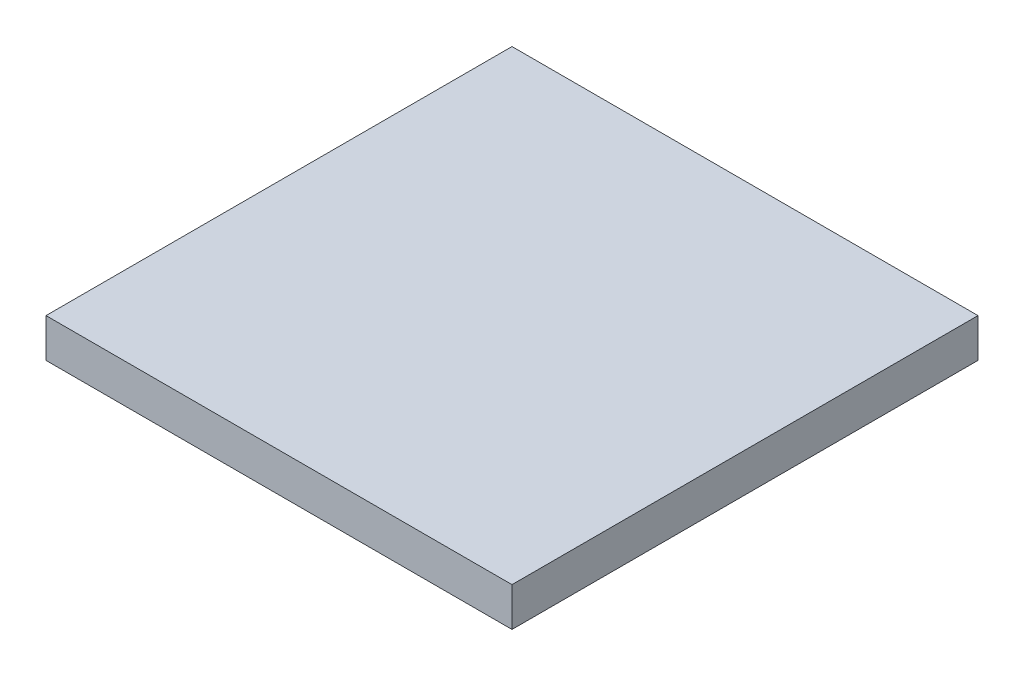
ISO-10303-21;
HEADER;
FILE_DESCRIPTION(('STEP AP214'),'2;1');
FILE_NAME('part.step','',(''),(''),'','','');
FILE_SCHEMA(('AUTOMOTIVE_DESIGN { 1 0 10303 214 1 1 1 1 }'));
ENDSEC;
DATA;
#1=APPLICATION_CONTEXT('core data for automotive mechanical design processes');
#2=APPLICATION_PROTOCOL_DEFINITION('international standard','automotive_design',2000,#1);
#3=PRODUCT_CONTEXT('',#1,'mechanical');
#4=PRODUCT('Part','Part','',(#3));
#5=PRODUCT_RELATED_PRODUCT_CATEGORY('part','',(#4));
#6=PRODUCT_DEFINITION_FORMATION('','',#4);
#7=PRODUCT_DEFINITION_CONTEXT('part definition',#1,'design');
#8=PRODUCT_DEFINITION('design','',#6,#7);
#9=PRODUCT_DEFINITION_SHAPE('','',#8);
#10=(LENGTH_UNIT() NAMED_UNIT(*) SI_UNIT(.MILLI.,.METRE.));
#11=(NAMED_UNIT(*) PLANE_ANGLE_UNIT() SI_UNIT($,.RADIAN.));
#12=(NAMED_UNIT(*) SI_UNIT($,.STERADIAN.) SOLID_ANGLE_UNIT());
#13=UNCERTAINTY_MEASURE_WITH_UNIT(LENGTH_MEASURE(1.E-05),#10,'distance_accuracy_value','');
#14=(GEOMETRIC_REPRESENTATION_CONTEXT(3) GLOBAL_UNCERTAINTY_ASSIGNED_CONTEXT((#13)) GLOBAL_UNIT_ASSIGNED_CONTEXT((#10,
#11,#12)) REPRESENTATION_CONTEXT('',''));
#15=CARTESIAN_POINT('',(0.,0.,0.));
#16=DIRECTION('',(0.,0.,1.));
#17=DIRECTION('',(1.,0.,0.));
#18=AXIS2_PLACEMENT_3D('',#15,#16,#17);
#19=CARTESIAN_POINT('',(5.97,10.7884215050598,-2.73));
#20=DIRECTION('',(-1.,0.,0.));
#21=DIRECTION('',(0.,0.,1.));
#22=AXIS2_PLACEMENT_3D('',#19,#20,#21);
#23=PLANE('',#22);
#24=DIRECTION('',(0.,0.,-1.));
#25=VECTOR('',#24,1.);
#26=CARTESIAN_POINT('',(5.97,5.78842150505978,-2.73));
#27=LINE('',#26,#25);
#28=CARTESIAN_POINT('',(5.97,5.78842150505978,2.73));
#29=VERTEX_POINT('',#28);
#30=CARTESIAN_POINT('',(5.97,5.78842150505978,-2.73));
#31=VERTEX_POINT('',#30);
#32=EDGE_CURVE('E134',#29,#31,#27,.T.);
#33=ORIENTED_EDGE('',*,*,#32,.T.);
#34=DIRECTION('',(0.,-1.,0.));
#35=VECTOR('',#34,1.);
#36=CARTESIAN_POINT('',(5.97,10.7884215050598,-2.73));
#37=LINE('',#36,#35);
#38=CARTESIAN_POINT('',(5.97,10.7884215050598,-2.73));
#39=VERTEX_POINT('',#38);
#40=EDGE_CURVE('E11',#39,#31,#37,.T.);
#41=ORIENTED_EDGE('',*,*,#40,.F.);
#42=DIRECTION('',(0.,0.,-1.));
#43=VECTOR('',#42,1.);
#44=CARTESIAN_POINT('',(5.97,10.7884215050598,-2.73));
#45=LINE('',#44,#43);
#46=CARTESIAN_POINT('',(5.97,10.7884215050598,2.73));
#47=VERTEX_POINT('',#46);
#48=EDGE_CURVE('E143',#47,#39,#45,.T.);
#49=ORIENTED_EDGE('',*,*,#48,.F.);
#50=DIRECTION('',(0.,-1.,0.));
#51=VECTOR('',#50,1.);
#52=CARTESIAN_POINT('',(5.97,10.7884215050598,2.73));
#53=LINE('',#52,#51);
#54=EDGE_CURVE('E152',#47,#29,#53,.T.);
#55=ORIENTED_EDGE('',*,*,#54,.T.);
#56=EDGE_LOOP('',(#33,#41,#49,#55));
#57=FACE_BOUND('',#56,.T.);
#58=ADVANCED_FACE('F36',(#57),#23,.F.);
#59=CARTESIAN_POINT('',(-5.97,10.7884215050598,-2.73));
#60=DIRECTION('',(0.,0.,1.));
#61=DIRECTION('',(1.,0.,0.));
#62=AXIS2_PLACEMENT_3D('',#59,#60,#61);
#63=PLANE('',#62);
#64=CARTESIAN_POINT('',(4.82,6.91342150505978,-2.73));
#65=DIRECTION('',(0.,0.,-1.));
#66=DIRECTION('',(1.,0.,0.));
#67=AXIS2_PLACEMENT_3D('',#64,#65,#66);
#68=CIRCLE('',#67,0.500000000000001);
#69=CARTESIAN_POINT('',(5.32,6.91342150505978,-2.73));
#70=VERTEX_POINT('',#69);
#71=EDGE_CURVE('E251',#70,#70,#68,.T.);
#72=ORIENTED_EDGE('',*,*,#71,.F.);
#73=EDGE_LOOP('',(#72));
#74=FACE_BOUND('',#73,.T.);
#75=CARTESIAN_POINT('',(4.82,9.16342150505978,-2.73));
#76=DIRECTION('',(0.,0.,-1.));
#77=DIRECTION('',(1.,0.,0.));
#78=AXIS2_PLACEMENT_3D('',#75,#76,#77);
#79=CIRCLE('',#78,0.500000000000001);
#80=CARTESIAN_POINT('',(5.32,9.16342150505978,-2.73));
#81=VERTEX_POINT('',#80);
#82=EDGE_CURVE('E257',#81,#81,#79,.T.);
#83=ORIENTED_EDGE('',*,*,#82,.F.);
#84=EDGE_LOOP('',(#83));
#85=FACE_BOUND('',#84,.T.);
#86=CARTESIAN_POINT('',(-4.82,9.16342150505978,-2.73));
#87=DIRECTION('',(0.,0.,-1.));
#88=DIRECTION('',(-1.,0.,0.));
#89=AXIS2_PLACEMENT_3D('',#86,#87,#88);
#90=CIRCLE('',#89,0.500000000000001);
#91=CARTESIAN_POINT('',(-5.32,9.16342150505978,-2.73));
#92=VERTEX_POINT('',#91);
#93=EDGE_CURVE('E263',#92,#92,#90,.T.);
#94=ORIENTED_EDGE('',*,*,#93,.F.);
#95=EDGE_LOOP('',(#94));
#96=FACE_BOUND('',#95,.T.);
#97=CARTESIAN_POINT('',(-4.82,6.91342150505978,-2.73));
#98=DIRECTION('',(0.,0.,-1.));
#99=DIRECTION('',(-1.,0.,0.));
#100=AXIS2_PLACEMENT_3D('',#97,#98,#99);
#101=CIRCLE('',#100,0.500000000000001);
#102=CARTESIAN_POINT('',(-5.32,6.91342150505978,-2.73));
#103=VERTEX_POINT('',#102);
#104=EDGE_CURVE('E245',#103,#103,#101,.T.);
#105=ORIENTED_EDGE('',*,*,#104,.F.);
#106=EDGE_LOOP('',(#105));
#107=FACE_BOUND('',#106,.T.);
#108=DIRECTION('',(-1.,0.,0.));
#109=VECTOR('',#108,1.);
#110=CARTESIAN_POINT('',(-5.97,5.78842150505978,-2.73));
#111=LINE('',#110,#109);
#112=CARTESIAN_POINT('',(-5.97,5.78842150505978,-2.73));
#113=VERTEX_POINT('',#112);
#114=EDGE_CURVE('E137',#31,#113,#111,.T.);
#115=ORIENTED_EDGE('',*,*,#114,.T.);
#116=DIRECTION('',(0.,-1.,0.));
#117=VECTOR('',#116,1.);
#118=CARTESIAN_POINT('',(-5.97,10.7884215050598,-2.73));
#119=LINE('',#118,#117);
#120=CARTESIAN_POINT('',(-5.97,10.7884215050598,-2.73));
#121=VERTEX_POINT('',#120);
#122=EDGE_CURVE('E44',#121,#113,#119,.T.);
#123=ORIENTED_EDGE('',*,*,#122,.F.);
#124=DIRECTION('',(-1.,0.,0.));
#125=VECTOR('',#124,1.);
#126=CARTESIAN_POINT('',(-5.97,10.7884215050598,-2.73));
#127=LINE('',#126,#125);
#128=EDGE_CURVE('E78',#39,#121,#127,.T.);
#129=ORIENTED_EDGE('',*,*,#128,.F.);
#130=ORIENTED_EDGE('',*,*,#40,.T.);
#131=EDGE_LOOP('',(#115,#123,#129,#130));
#132=FACE_BOUND('',#131,.T.);
#133=ADVANCED_FACE('F178',(#74,#85,#96,#107,#132),#63,.F.);
#134=CARTESIAN_POINT('',(-5.97,10.7884215050598,-2.73));
#135=DIRECTION('',(1.,0.,0.));
#136=DIRECTION('',(0.,0.,-1.));
#137=AXIS2_PLACEMENT_3D('',#134,#135,#136);
#138=PLANE('',#137);
#139=DIRECTION('',(0.,0.,1.));
#140=VECTOR('',#139,1.);
#141=CARTESIAN_POINT('',(-5.97,5.78842150505978,-2.73));
#142=LINE('',#141,#140);
#143=CARTESIAN_POINT('',(-5.97,5.78842150505978,2.73));
#144=VERTEX_POINT('',#143);
#145=EDGE_CURVE('E68',#113,#144,#142,.T.);
#146=ORIENTED_EDGE('',*,*,#145,.T.);
#147=DIRECTION('',(0.,-1.,0.));
#148=VECTOR('',#147,1.);
#149=CARTESIAN_POINT('',(-5.97,10.7884215050598,2.73));
#150=LINE('',#149,#148);
#151=CARTESIAN_POINT('',(-5.97,10.7884215050598,2.73));
#152=VERTEX_POINT('',#151);
#153=EDGE_CURVE('E52',#152,#144,#150,.T.);
#154=ORIENTED_EDGE('',*,*,#153,.F.);
#155=DIRECTION('',(0.,0.,1.));
#156=VECTOR('',#155,1.);
#157=CARTESIAN_POINT('',(-5.97,10.7884215050598,-2.73));
#158=LINE('',#157,#156);
#159=EDGE_CURVE('E147',#121,#152,#158,.T.);
#160=ORIENTED_EDGE('',*,*,#159,.F.);
#161=ORIENTED_EDGE('',*,*,#122,.T.);
#162=EDGE_LOOP('',(#146,#154,#160,#161));
#163=FACE_BOUND('',#162,.T.);
#164=ADVANCED_FACE('F158',(#163),#138,.F.);
#165=CARTESIAN_POINT('',(-5.97,10.7884215050598,2.73));
#166=DIRECTION('',(0.,0.,-1.));
#167=DIRECTION('',(-1.,0.,0.));
#168=AXIS2_PLACEMENT_3D('',#165,#166,#167);
#169=PLANE('',#168);
#170=CARTESIAN_POINT('',(-4.82,6.91342150505978,2.73));
#171=DIRECTION('',(0.,0.,1.));
#172=DIRECTION('',(-1.,0.,0.));
#173=AXIS2_PLACEMENT_3D('',#170,#171,#172);
#174=CIRCLE('',#173,0.5);
#175=CARTESIAN_POINT('',(-5.32,6.91342150505978,2.73));
#176=VERTEX_POINT('',#175);
#177=EDGE_CURVE('E227',#176,#176,#174,.T.);
#178=ORIENTED_EDGE('',*,*,#177,.F.);
#179=EDGE_LOOP('',(#178));
#180=FACE_BOUND('',#179,.T.);
#181=CARTESIAN_POINT('',(-4.82,9.16342150505978,2.73));
#182=DIRECTION('',(0.,0.,1.));
#183=DIRECTION('',(-1.,0.,0.));
#184=AXIS2_PLACEMENT_3D('',#181,#182,#183);
#185=CIRCLE('',#184,0.5);
#186=CARTESIAN_POINT('',(-5.32,9.16342150505978,2.73));
#187=VERTEX_POINT('',#186);
#188=EDGE_CURVE('E234',#187,#187,#185,.T.);
#189=ORIENTED_EDGE('',*,*,#188,.F.);
#190=EDGE_LOOP('',(#189));
#191=FACE_BOUND('',#190,.T.);
#192=CARTESIAN_POINT('',(4.82,9.16342150505978,2.73));
#193=DIRECTION('',(0.,0.,1.));
#194=DIRECTION('',(1.,0.,0.));
#195=AXIS2_PLACEMENT_3D('',#192,#193,#194);
#196=CIRCLE('',#195,0.5);
#197=CARTESIAN_POINT('',(5.32,9.16342150505978,2.73));
#198=VERTEX_POINT('',#197);
#199=EDGE_CURVE('E240',#198,#198,#196,.T.);
#200=ORIENTED_EDGE('',*,*,#199,.F.);
#201=EDGE_LOOP('',(#200));
#202=FACE_BOUND('',#201,.T.);
#203=CARTESIAN_POINT('',(4.82,6.91342150505978,2.73));
#204=DIRECTION('',(0.,0.,1.));
#205=DIRECTION('',(1.,0.,0.));
#206=AXIS2_PLACEMENT_3D('',#203,#204,#205);
#207=CIRCLE('',#206,0.5);
#208=CARTESIAN_POINT('',(5.32,6.91342150505978,2.73));
#209=VERTEX_POINT('',#208);
#210=EDGE_CURVE('E218',#209,#209,#207,.T.);
#211=ORIENTED_EDGE('',*,*,#210,.F.);
#212=EDGE_LOOP('',(#211));
#213=FACE_BOUND('',#212,.T.);
#214=DIRECTION('',(1.,0.,0.));
#215=VECTOR('',#214,1.);
#216=CARTESIAN_POINT('',(-5.97,5.78842150505978,2.73));
#217=LINE('',#216,#215);
#218=EDGE_CURVE('E73',#144,#29,#217,.T.);
#219=ORIENTED_EDGE('',*,*,#218,.T.);
#220=ORIENTED_EDGE('',*,*,#54,.F.);
#221=DIRECTION('',(1.,0.,0.));
#222=VECTOR('',#221,1.);
#223=CARTESIAN_POINT('',(-5.97,10.7884215050598,2.73));
#224=LINE('',#223,#222);
#225=EDGE_CURVE('E150',#152,#47,#224,.T.);
#226=ORIENTED_EDGE('',*,*,#225,.F.);
#227=ORIENTED_EDGE('',*,*,#153,.T.);
#228=EDGE_LOOP('',(#219,#220,#226,#227));
#229=FACE_BOUND('',#228,.T.);
#230=ADVANCED_FACE('F163',(#180,#191,#202,#213,#229),#169,.F.);
#231=CARTESIAN_POINT('',(0.,5.78842150505978,0.));
#232=DIRECTION('',(0.,1.,0.));
#233=DIRECTION('',(0.,0.,1.));
#234=AXIS2_PLACEMENT_3D('',#231,#232,#233);
#235=PLANE('',#234);
#236=ORIENTED_EDGE('',*,*,#32,.F.);
#237=ORIENTED_EDGE('',*,*,#218,.F.);
#238=ORIENTED_EDGE('',*,*,#145,.F.);
#239=ORIENTED_EDGE('',*,*,#114,.F.);
#240=EDGE_LOOP('',(#236,#237,#238,#239));
#241=FACE_BOUND('',#240,.T.);
#242=ADVANCED_FACE('F161',(#241),#235,.F.);
#243=CARTESIAN_POINT('',(0.,10.7884215050598,0.));
#244=DIRECTION('',(0.,1.,0.));
#245=DIRECTION('',(0.,0.,1.));
#246=AXIS2_PLACEMENT_3D('',#243,#244,#245);
#247=PLANE('',#246);
#248=DIRECTION('',(0.,0.,-1.));
#249=VECTOR('',#248,1.);
#250=CARTESIAN_POINT('',(15.,10.7884215050598,-15.));
#251=LINE('',#250,#249);
#252=CARTESIAN_POINT('',(15.,10.7884215050598,15.));
#253=VERTEX_POINT('',#252);
#254=CARTESIAN_POINT('',(15.,10.7884215050598,-15.));
#255=VERTEX_POINT('',#254);
#256=EDGE_CURVE('E133',#253,#255,#251,.T.);
#257=ORIENTED_EDGE('',*,*,#256,.F.);
#258=DIRECTION('',(1.,0.,0.));
#259=VECTOR('',#258,1.);
#260=CARTESIAN_POINT('',(-15.,10.7884215050598,15.));
#261=LINE('',#260,#259);
#262=CARTESIAN_POINT('',(-15.,10.7884215050598,15.));
#263=VERTEX_POINT('',#262);
#264=EDGE_CURVE('E129',#263,#253,#261,.T.);
#265=ORIENTED_EDGE('',*,*,#264,.F.);
#266=DIRECTION('',(0.,0.,1.));
#267=VECTOR('',#266,1.);
#268=CARTESIAN_POINT('',(-15.,10.7884215050598,-15.));
#269=LINE('',#268,#267);
#270=CARTESIAN_POINT('',(-15.,10.7884215050598,-15.));
#271=VERTEX_POINT('',#270);
#272=EDGE_CURVE('E210',#271,#263,#269,.T.);
#273=ORIENTED_EDGE('',*,*,#272,.F.);
#274=DIRECTION('',(-1.,0.,0.));
#275=VECTOR('',#274,1.);
#276=CARTESIAN_POINT('',(-15.,10.7884215050598,-15.));
#277=LINE('',#276,#275);
#278=EDGE_CURVE('E213',#255,#271,#277,.T.);
#279=ORIENTED_EDGE('',*,*,#278,.F.);
#280=EDGE_LOOP('',(#257,#265,#273,#279));
#281=FACE_BOUND('',#280,.T.);
#282=ORIENTED_EDGE('',*,*,#225,.T.);
#283=ORIENTED_EDGE('',*,*,#48,.T.);
#284=ORIENTED_EDGE('',*,*,#128,.T.);
#285=ORIENTED_EDGE('',*,*,#159,.T.);
#286=EDGE_LOOP('',(#282,#283,#284,#285));
#287=FACE_BOUND('',#286,.T.);
#288=ADVANCED_FACE('F165',(#281,#287),#247,.F.);
#289=CARTESIAN_POINT('',(15.,13.2884215050598,-15.));
#290=DIRECTION('',(-1.,0.,0.));
#291=DIRECTION('',(0.,0.,1.));
#292=AXIS2_PLACEMENT_3D('',#289,#290,#291);
#293=PLANE('',#292);
#294=ORIENTED_EDGE('',*,*,#256,.T.);
#295=DIRECTION('',(0.,-1.,0.));
#296=VECTOR('',#295,1.);
#297=CARTESIAN_POINT('',(15.,13.2884215050598,-15.));
#298=LINE('',#297,#296);
#299=CARTESIAN_POINT('',(15.,13.2884215050598,-15.));
#300=VERTEX_POINT('',#299);
#301=EDGE_CURVE('E113',#300,#255,#298,.T.);
#302=ORIENTED_EDGE('',*,*,#301,.F.);
#303=DIRECTION('',(0.,0.,-1.));
#304=VECTOR('',#303,1.);
#305=CARTESIAN_POINT('',(15.,13.2884215050598,-15.));
#306=LINE('',#305,#304);
#307=CARTESIAN_POINT('',(15.,13.2884215050598,15.));
#308=VERTEX_POINT('',#307);
#309=EDGE_CURVE('E120',#308,#300,#306,.T.);
#310=ORIENTED_EDGE('',*,*,#309,.F.);
#311=DIRECTION('',(0.,-1.,0.));
#312=VECTOR('',#311,1.);
#313=CARTESIAN_POINT('',(15.,13.2884215050598,15.));
#314=LINE('',#313,#312);
#315=EDGE_CURVE('E207',#308,#253,#314,.T.);
#316=ORIENTED_EDGE('',*,*,#315,.T.);
#317=EDGE_LOOP('',(#294,#302,#310,#316));
#318=FACE_BOUND('',#317,.T.);
#319=ADVANCED_FACE('F131',(#318),#293,.F.);
#320=CARTESIAN_POINT('',(-15.,13.2884215050598,-15.));
#321=DIRECTION('',(0.,0.,1.));
#322=DIRECTION('',(1.,0.,0.));
#323=AXIS2_PLACEMENT_3D('',#320,#321,#322);
#324=PLANE('',#323);
#325=ORIENTED_EDGE('',*,*,#278,.T.);
#326=DIRECTION('',(0.,-1.,0.));
#327=VECTOR('',#326,1.);
#328=CARTESIAN_POINT('',(-15.,13.2884215050598,-15.));
#329=LINE('',#328,#327);
#330=CARTESIAN_POINT('',(-15.,13.2884215050598,-15.));
#331=VERTEX_POINT('',#330);
#332=EDGE_CURVE('E116',#331,#271,#329,.T.);
#333=ORIENTED_EDGE('',*,*,#332,.F.);
#334=DIRECTION('',(-1.,0.,0.));
#335=VECTOR('',#334,1.);
#336=CARTESIAN_POINT('',(-15.,13.2884215050598,-15.));
#337=LINE('',#336,#335);
#338=EDGE_CURVE('E109',#300,#331,#337,.T.);
#339=ORIENTED_EDGE('',*,*,#338,.F.);
#340=ORIENTED_EDGE('',*,*,#301,.T.);
#341=EDGE_LOOP('',(#325,#333,#339,#340));
#342=FACE_BOUND('',#341,.T.);
#343=ADVANCED_FACE('F111',(#342),#324,.F.);
#344=CARTESIAN_POINT('',(-15.,13.2884215050598,-15.));
#345=DIRECTION('',(1.,0.,0.));
#346=DIRECTION('',(0.,0.,-1.));
#347=AXIS2_PLACEMENT_3D('',#344,#345,#346);
#348=PLANE('',#347);
#349=ORIENTED_EDGE('',*,*,#272,.T.);
#350=DIRECTION('',(0.,-1.,0.));
#351=VECTOR('',#350,1.);
#352=CARTESIAN_POINT('',(-15.,13.2884215050598,15.));
#353=LINE('',#352,#351);
#354=CARTESIAN_POINT('',(-15.,13.2884215050598,15.));
#355=VERTEX_POINT('',#354);
#356=EDGE_CURVE('E139',#355,#263,#353,.T.);
#357=ORIENTED_EDGE('',*,*,#356,.F.);
#358=DIRECTION('',(0.,0.,1.));
#359=VECTOR('',#358,1.);
#360=CARTESIAN_POINT('',(-15.,13.2884215050598,-15.));
#361=LINE('',#360,#359);
#362=EDGE_CURVE('E119',#331,#355,#361,.T.);
#363=ORIENTED_EDGE('',*,*,#362,.F.);
#364=ORIENTED_EDGE('',*,*,#332,.T.);
#365=EDGE_LOOP('',(#349,#357,#363,#364));
#366=FACE_BOUND('',#365,.T.);
#367=ADVANCED_FACE('F195',(#366),#348,.F.);
#368=CARTESIAN_POINT('',(-15.,13.2884215050598,15.));
#369=DIRECTION('',(0.,0.,-1.));
#370=DIRECTION('',(-1.,0.,0.));
#371=AXIS2_PLACEMENT_3D('',#368,#369,#370);
#372=PLANE('',#371);
#373=ORIENTED_EDGE('',*,*,#264,.T.);
#374=ORIENTED_EDGE('',*,*,#315,.F.);
#375=DIRECTION('',(1.,0.,0.));
#376=VECTOR('',#375,1.);
#377=CARTESIAN_POINT('',(-15.,13.2884215050598,15.));
#378=LINE('',#377,#376);
#379=EDGE_CURVE('E125',#355,#308,#378,.T.);
#380=ORIENTED_EDGE('',*,*,#379,.F.);
#381=ORIENTED_EDGE('',*,*,#356,.T.);
#382=EDGE_LOOP('',(#373,#374,#380,#381));
#383=FACE_BOUND('',#382,.T.);
#384=ADVANCED_FACE('F197',(#383),#372,.F.);
#385=CARTESIAN_POINT('',(0.,13.2884215050598,0.));
#386=DIRECTION('',(0.,1.,0.));
#387=DIRECTION('',(0.,0.,1.));
#388=AXIS2_PLACEMENT_3D('',#385,#386,#387);
#389=PLANE('',#388);
#390=ORIENTED_EDGE('',*,*,#309,.T.);
#391=ORIENTED_EDGE('',*,*,#338,.T.);
#392=ORIENTED_EDGE('',*,*,#362,.T.);
#393=ORIENTED_EDGE('',*,*,#379,.T.);
#394=EDGE_LOOP('',(#390,#391,#392,#393));
#395=FACE_BOUND('',#394,.T.);
#396=ADVANCED_FACE('F123',(#395),#389,.T.);
#397=CARTESIAN_POINT('',(4.82,6.91342150505978,1.23));
#398=DIRECTION('',(0.,0.,1.));
#399=DIRECTION('',(1.,0.,0.));
#400=AXIS2_PLACEMENT_3D('',#397,#398,#399);
#401=CYLINDRICAL_SURFACE('',#400,0.5);
#402=CARTESIAN_POINT('',(4.82,6.91342150505978,1.23));
#403=DIRECTION('',(0.,0.,1.));
#404=DIRECTION('',(1.,0.,0.));
#405=AXIS2_PLACEMENT_3D('',#402,#403,#404);
#406=CIRCLE('',#405,0.5);
#407=CARTESIAN_POINT('',(5.32,6.91342150505978,1.23));
#408=VERTEX_POINT('',#407);
#409=EDGE_CURVE('E214',#408,#408,#406,.T.);
#410=ORIENTED_EDGE('',*,*,#409,.F.);
#411=EDGE_LOOP('',(#410));
#412=FACE_BOUND('',#411,.T.);
#413=ORIENTED_EDGE('',*,*,#210,.T.);
#414=EDGE_LOOP('',(#413));
#415=FACE_BOUND('',#414,.T.);
#416=ADVANCED_FACE('F204',(#412,#415),#401,.F.);
#417=CARTESIAN_POINT('',(4.82,6.91342150505978,1.23));
#418=DIRECTION('',(0.,0.,1.));
#419=DIRECTION('',(1.,0.,0.));
#420=AXIS2_PLACEMENT_3D('',#417,#418,#419);
#421=PLANE('',#420);
#422=ORIENTED_EDGE('',*,*,#409,.T.);
#423=EDGE_LOOP('',(#422));
#424=FACE_BOUND('',#423,.T.);
#425=ADVANCED_FACE('F306',(#424),#421,.T.);
#426=CARTESIAN_POINT('',(4.82,9.16342150505978,1.23));
#427=DIRECTION('',(0.,0.,1.));
#428=DIRECTION('',(1.,0.,0.));
#429=AXIS2_PLACEMENT_3D('',#426,#427,#428);
#430=CYLINDRICAL_SURFACE('',#429,0.5);
#431=CARTESIAN_POINT('',(4.82,9.16342150505978,1.23));
#432=DIRECTION('',(0.,0.,1.));
#433=DIRECTION('',(1.,0.,0.));
#434=AXIS2_PLACEMENT_3D('',#431,#432,#433);
#435=CIRCLE('',#434,0.5);
#436=CARTESIAN_POINT('',(5.32,9.16342150505978,1.23));
#437=VERTEX_POINT('',#436);
#438=EDGE_CURVE('E225',#437,#437,#435,.T.);
#439=ORIENTED_EDGE('',*,*,#438,.F.);
#440=EDGE_LOOP('',(#439));
#441=FACE_BOUND('',#440,.T.);
#442=ORIENTED_EDGE('',*,*,#199,.T.);
#443=EDGE_LOOP('',(#442));
#444=FACE_BOUND('',#443,.T.);
#445=ADVANCED_FACE('F302',(#441,#444),#430,.F.);
#446=CARTESIAN_POINT('',(4.82,9.16342150505978,1.23));
#447=DIRECTION('',(0.,0.,1.));
#448=DIRECTION('',(1.,0.,0.));
#449=AXIS2_PLACEMENT_3D('',#446,#447,#448);
#450=PLANE('',#449);
#451=ORIENTED_EDGE('',*,*,#438,.T.);
#452=EDGE_LOOP('',(#451));
#453=FACE_BOUND('',#452,.T.);
#454=ADVANCED_FACE('F298',(#453),#450,.T.);
#455=CARTESIAN_POINT('',(-4.82,9.16342150505978,1.23));
#456=DIRECTION('',(0.,0.,1.));
#457=DIRECTION('',(1.,0.,0.));
#458=AXIS2_PLACEMENT_3D('',#455,#456,#457);
#459=CYLINDRICAL_SURFACE('',#458,0.5);
#460=CARTESIAN_POINT('',(-4.82,9.16342150505978,1.23));
#461=DIRECTION('',(0.,0.,1.));
#462=DIRECTION('',(-1.,0.,0.));
#463=AXIS2_PLACEMENT_3D('',#460,#461,#462);
#464=CIRCLE('',#463,0.5);
#465=CARTESIAN_POINT('',(-5.32,9.16342150505978,1.23));
#466=VERTEX_POINT('',#465);
#467=EDGE_CURVE('E237',#466,#466,#464,.T.);
#468=ORIENTED_EDGE('',*,*,#467,.F.);
#469=EDGE_LOOP('',(#468));
#470=FACE_BOUND('',#469,.T.);
#471=ORIENTED_EDGE('',*,*,#188,.T.);
#472=EDGE_LOOP('',(#471));
#473=FACE_BOUND('',#472,.T.);
#474=ADVANCED_FACE('F301',(#470,#473),#459,.F.);
#475=CARTESIAN_POINT('',(-4.82,9.16342150505978,1.23));
#476=DIRECTION('',(0.,0.,-1.));
#477=DIRECTION('',(-1.,0.,0.));
#478=AXIS2_PLACEMENT_3D('',#475,#476,#477);
#479=PLANE('',#478);
#480=ORIENTED_EDGE('',*,*,#467,.T.);
#481=EDGE_LOOP('',(#480));
#482=FACE_BOUND('',#481,.T.);
#483=ADVANCED_FACE('F308',(#482),#479,.F.);
#484=CARTESIAN_POINT('',(-4.82,6.91342150505978,1.23));
#485=DIRECTION('',(0.,0.,1.));
#486=DIRECTION('',(1.,0.,0.));
#487=AXIS2_PLACEMENT_3D('',#484,#485,#486);
#488=CYLINDRICAL_SURFACE('',#487,0.5);
#489=CARTESIAN_POINT('',(-4.82,6.91342150505978,1.23));
#490=DIRECTION('',(0.,0.,1.));
#491=DIRECTION('',(-1.,0.,0.));
#492=AXIS2_PLACEMENT_3D('',#489,#490,#491);
#493=CIRCLE('',#492,0.5);
#494=CARTESIAN_POINT('',(-5.32,6.91342150505978,1.23));
#495=VERTEX_POINT('',#494);
#496=EDGE_CURVE('E230',#495,#495,#493,.T.);
#497=ORIENTED_EDGE('',*,*,#496,.F.);
#498=EDGE_LOOP('',(#497));
#499=FACE_BOUND('',#498,.T.);
#500=ORIENTED_EDGE('',*,*,#177,.T.);
#501=EDGE_LOOP('',(#500));
#502=FACE_BOUND('',#501,.T.);
#503=ADVANCED_FACE('F292',(#499,#502),#488,.F.);
#504=CARTESIAN_POINT('',(-4.82,6.91342150505978,1.23));
#505=DIRECTION('',(0.,0.,-1.));
#506=DIRECTION('',(-1.,0.,0.));
#507=AXIS2_PLACEMENT_3D('',#504,#505,#506);
#508=PLANE('',#507);
#509=ORIENTED_EDGE('',*,*,#496,.T.);
#510=EDGE_LOOP('',(#509));
#511=FACE_BOUND('',#510,.T.);
#512=ADVANCED_FACE('F283',(#511),#508,.F.);
#513=CARTESIAN_POINT('',(-4.82,6.91342150505978,-1.23));
#514=DIRECTION('',(0.,0.,-1.));
#515=DIRECTION('',(-1.,0.,0.));
#516=AXIS2_PLACEMENT_3D('',#513,#514,#515);
#517=CYLINDRICAL_SURFACE('',#516,0.500000000000001);
#518=CARTESIAN_POINT('',(-4.82,6.91342150505978,-1.23));
#519=DIRECTION('',(0.,0.,-1.));
#520=DIRECTION('',(-1.,0.,0.));
#521=AXIS2_PLACEMENT_3D('',#518,#519,#520);
#522=CIRCLE('',#521,0.500000000000001);
#523=CARTESIAN_POINT('',(-5.32,6.91342150505978,-1.23));
#524=VERTEX_POINT('',#523);
#525=EDGE_CURVE('E231',#524,#524,#522,.T.);
#526=ORIENTED_EDGE('',*,*,#525,.F.);
#527=EDGE_LOOP('',(#526));
#528=FACE_BOUND('',#527,.T.);
#529=ORIENTED_EDGE('',*,*,#104,.T.);
#530=EDGE_LOOP('',(#529));
#531=FACE_BOUND('',#530,.T.);
#532=ADVANCED_FACE('F281',(#528,#531),#517,.F.);
#533=CARTESIAN_POINT('',(-4.82,6.91342150505978,-1.23));
#534=DIRECTION('',(0.,0.,-1.));
#535=DIRECTION('',(-1.,0.,0.));
#536=AXIS2_PLACEMENT_3D('',#533,#534,#535);
#537=PLANE('',#536);
#538=ORIENTED_EDGE('',*,*,#525,.T.);
#539=EDGE_LOOP('',(#538));
#540=FACE_BOUND('',#539,.T.);
#541=ADVANCED_FACE('F274',(#540),#537,.T.);
#542=CARTESIAN_POINT('',(-4.82,9.16342150505978,-1.23));
#543=DIRECTION('',(0.,0.,-1.));
#544=DIRECTION('',(-1.,0.,0.));
#545=AXIS2_PLACEMENT_3D('',#542,#543,#544);
#546=CYLINDRICAL_SURFACE('',#545,0.500000000000001);
#547=CARTESIAN_POINT('',(-4.82,9.16342150505978,-1.23));
#548=DIRECTION('',(0.,0.,-1.));
#549=DIRECTION('',(-1.,0.,0.));
#550=AXIS2_PLACEMENT_3D('',#547,#548,#549);
#551=CIRCLE('',#550,0.500000000000001);
#552=CARTESIAN_POINT('',(-5.32,9.16342150505978,-1.23));
#553=VERTEX_POINT('',#552);
#554=EDGE_CURVE('E248',#553,#553,#551,.T.);
#555=ORIENTED_EDGE('',*,*,#554,.F.);
#556=EDGE_LOOP('',(#555));
#557=FACE_BOUND('',#556,.T.);
#558=ORIENTED_EDGE('',*,*,#93,.T.);
#559=EDGE_LOOP('',(#558));
#560=FACE_BOUND('',#559,.T.);
#561=ADVANCED_FACE('F271',(#557,#560),#546,.F.);
#562=CARTESIAN_POINT('',(-4.82,9.16342150505978,-1.23));
#563=DIRECTION('',(0.,0.,-1.));
#564=DIRECTION('',(-1.,0.,0.));
#565=AXIS2_PLACEMENT_3D('',#562,#563,#564);
#566=PLANE('',#565);
#567=ORIENTED_EDGE('',*,*,#554,.T.);
#568=EDGE_LOOP('',(#567));
#569=FACE_BOUND('',#568,.T.);
#570=ADVANCED_FACE('F269',(#569),#566,.T.);
#571=CARTESIAN_POINT('',(4.82,9.16342150505978,-1.23));
#572=DIRECTION('',(0.,0.,-1.));
#573=DIRECTION('',(-1.,0.,0.));
#574=AXIS2_PLACEMENT_3D('',#571,#572,#573);
#575=CYLINDRICAL_SURFACE('',#574,0.500000000000001);
#576=CARTESIAN_POINT('',(4.82,9.16342150505978,-1.23));
#577=DIRECTION('',(0.,0.,-1.));
#578=DIRECTION('',(1.,0.,0.));
#579=AXIS2_PLACEMENT_3D('',#576,#577,#578);
#580=CIRCLE('',#579,0.500000000000001);
#581=CARTESIAN_POINT('',(5.32,9.16342150505978,-1.23));
#582=VERTEX_POINT('',#581);
#583=EDGE_CURVE('E260',#582,#582,#580,.T.);
#584=ORIENTED_EDGE('',*,*,#583,.F.);
#585=EDGE_LOOP('',(#584));
#586=FACE_BOUND('',#585,.T.);
#587=ORIENTED_EDGE('',*,*,#82,.T.);
#588=EDGE_LOOP('',(#587));
#589=FACE_BOUND('',#588,.T.);
#590=ADVANCED_FACE('F384',(#586,#589),#575,.F.);
#591=CARTESIAN_POINT('',(4.82,9.16342150505978,-1.23));
#592=DIRECTION('',(0.,0.,1.));
#593=DIRECTION('',(1.,0.,0.));
#594=AXIS2_PLACEMENT_3D('',#591,#592,#593);
#595=PLANE('',#594);
#596=ORIENTED_EDGE('',*,*,#583,.T.);
#597=EDGE_LOOP('',(#596));
#598=FACE_BOUND('',#597,.T.);
#599=ADVANCED_FACE('F393',(#598),#595,.F.);
#600=CARTESIAN_POINT('',(4.82,6.91342150505978,-1.23));
#601=DIRECTION('',(0.,0.,-1.));
#602=DIRECTION('',(-1.,0.,0.));
#603=AXIS2_PLACEMENT_3D('',#600,#601,#602);
#604=CYLINDRICAL_SURFACE('',#603,0.500000000000001);
#605=CARTESIAN_POINT('',(4.82,6.91342150505978,-1.23));
#606=DIRECTION('',(0.,0.,-1.));
#607=DIRECTION('',(1.,0.,0.));
#608=AXIS2_PLACEMENT_3D('',#605,#606,#607);
#609=CIRCLE('',#608,0.500000000000001);
#610=CARTESIAN_POINT('',(5.32,6.91342150505978,-1.23));
#611=VERTEX_POINT('',#610);
#612=EDGE_CURVE('E254',#611,#611,#609,.T.);
#613=ORIENTED_EDGE('',*,*,#612,.F.);
#614=EDGE_LOOP('',(#613));
#615=FACE_BOUND('',#614,.T.);
#616=ORIENTED_EDGE('',*,*,#71,.T.);
#617=EDGE_LOOP('',(#616));
#618=FACE_BOUND('',#617,.T.);
#619=ADVANCED_FACE('F403',(#615,#618),#604,.F.);
#620=CARTESIAN_POINT('',(4.82,6.91342150505978,-1.23));
#621=DIRECTION('',(0.,0.,1.));
#622=DIRECTION('',(1.,0.,0.));
#623=AXIS2_PLACEMENT_3D('',#620,#621,#622);
#624=PLANE('',#623);
#625=ORIENTED_EDGE('',*,*,#612,.T.);
#626=EDGE_LOOP('',(#625));
#627=FACE_BOUND('',#626,.T.);
#628=ADVANCED_FACE('F413',(#627),#624,.F.);
#629=CLOSED_SHELL('',(#58,#133,#164,#230,#242,#288,#319,#343,#367,#384,#396,#416,#425,#445,#454,
#474,#483,#503,#512,#532,#541,#561,#570,#590,#599,#619,#628));
#630=MANIFOLD_SOLID_BREP('B2',#629);
#631=ADVANCED_BREP_SHAPE_REPRESENTATION('',(#18,#630),#14);
#632=SHAPE_DEFINITION_REPRESENTATION(#9,#631);
ENDSEC;
END-ISO-10303-21;
